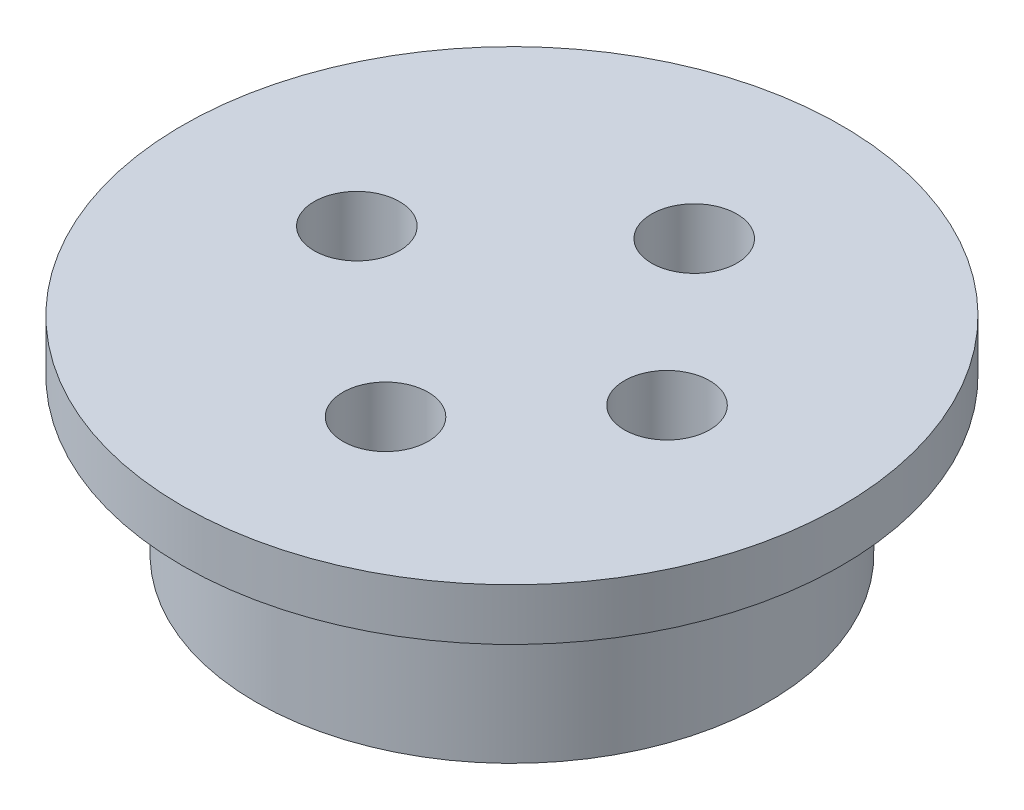
ISO-10303-21;
HEADER;
FILE_DESCRIPTION(('STEP AP214'),'2;1');
FILE_NAME('part.step','',(''),(''),'','','');
FILE_SCHEMA(('AUTOMOTIVE_DESIGN { 1 0 10303 214 1 1 1 1 }'));
ENDSEC;
DATA;
#1=APPLICATION_CONTEXT('core data for automotive mechanical design processes');
#2=APPLICATION_PROTOCOL_DEFINITION('international standard','automotive_design',2000,#1);
#3=PRODUCT_CONTEXT('',#1,'mechanical');
#4=PRODUCT('Part','Part','',(#3));
#5=PRODUCT_RELATED_PRODUCT_CATEGORY('part','',(#4));
#6=PRODUCT_DEFINITION_FORMATION('','',#4);
#7=PRODUCT_DEFINITION_CONTEXT('part definition',#1,'design');
#8=PRODUCT_DEFINITION('design','',#6,#7);
#9=PRODUCT_DEFINITION_SHAPE('','',#8);
#10=(LENGTH_UNIT() NAMED_UNIT(*) SI_UNIT(.MILLI.,.METRE.));
#11=(NAMED_UNIT(*) PLANE_ANGLE_UNIT() SI_UNIT($,.RADIAN.));
#12=(NAMED_UNIT(*) SI_UNIT($,.STERADIAN.) SOLID_ANGLE_UNIT());
#13=UNCERTAINTY_MEASURE_WITH_UNIT(LENGTH_MEASURE(1.E-05),#10,'distance_accuracy_value','');
#14=(GEOMETRIC_REPRESENTATION_CONTEXT(3) GLOBAL_UNCERTAINTY_ASSIGNED_CONTEXT((#13)) GLOBAL_UNIT_ASSIGNED_CONTEXT((#10,
#11,#12)) REPRESENTATION_CONTEXT('',''));
#15=CARTESIAN_POINT('',(0.,0.,0.));
#16=DIRECTION('',(0.,0.,1.));
#17=DIRECTION('',(1.,0.,0.));
#18=AXIS2_PLACEMENT_3D('',#15,#16,#17);
#19=CARTESIAN_POINT('',(-0.930712345753705,-8.,-0.80457804546197));
#20=DIRECTION('',(0.,1.,0.));
#21=DIRECTION('',(0.,0.,1.));
#22=AXIS2_PLACEMENT_3D('',#19,#20,#21);
#23=CYLINDRICAL_SURFACE('',#22,9.9);
#24=CARTESIAN_POINT('',(-0.930712345753705,-8.,-0.80457804546197));
#25=DIRECTION('',(0.,1.,0.));
#26=DIRECTION('',(0.,0.,1.));
#27=AXIS2_PLACEMENT_3D('',#24,#25,#26);
#28=CIRCLE('',#27,9.9);
#29=CARTESIAN_POINT('',(-0.930712345753705,-8.,9.09542195453803));
#30=VERTEX_POINT('',#29);
#31=EDGE_CURVE('E10',#30,#30,#28,.T.);
#32=ORIENTED_EDGE('',*,*,#31,.T.);
#33=EDGE_LOOP('',(#32));
#34=FACE_BOUND('',#33,.T.);
#35=CARTESIAN_POINT('',(-0.930712345753705,-2.,-0.80457804546197));
#36=DIRECTION('',(0.,1.,0.));
#37=DIRECTION('',(0.,0.,1.));
#38=AXIS2_PLACEMENT_3D('',#35,#36,#37);
#39=CIRCLE('',#38,9.9);
#40=CARTESIAN_POINT('',(-0.930712345753705,-2.,9.09542195453803));
#41=VERTEX_POINT('',#40);
#42=EDGE_CURVE('E42',#41,#41,#39,.F.);
#43=ORIENTED_EDGE('',*,*,#42,.T.);
#44=EDGE_LOOP('',(#43));
#45=FACE_BOUND('',#44,.T.);
#46=ADVANCED_FACE('F40',(#34,#45),#23,.T.);
#47=CARTESIAN_POINT('',(-0.930712345753705,-8.,-0.80457804546197));
#48=DIRECTION('',(0.,1.,0.));
#49=DIRECTION('',(0.,0.,1.));
#50=AXIS2_PLACEMENT_3D('',#47,#48,#49);
#51=PLANE('',#50);
#52=CARTESIAN_POINT('',(0.0121816289295595,-8.,5.02797613553002));
#53=DIRECTION('',(0.,1.,0.));
#54=DIRECTION('',(0.,0.,1.));
#55=AXIS2_PLACEMENT_3D('',#52,#53,#54);
#56=CIRCLE('',#55,3.);
#57=CARTESIAN_POINT('',(0.0121816289295595,-8.,8.02797613553002));
#58=VERTEX_POINT('',#57);
#59=EDGE_CURVE('E65',#58,#58,#56,.T.);
#60=ORIENTED_EDGE('',*,*,#59,.T.);
#61=EDGE_LOOP('',(#60));
#62=FACE_BOUND('',#61,.T.);
#63=CARTESIAN_POINT('',(0.0121816289295595,-8.,-6.91406555217959));
#64=DIRECTION('',(0.,1.,0.));
#65=DIRECTION('',(0.,0.,1.));
#66=AXIS2_PLACEMENT_3D('',#63,#64,#65);
#67=CIRCLE('',#66,3.);
#68=CARTESIAN_POINT('',(0.0121816289295595,-8.,-3.91406555217959));
#69=VERTEX_POINT('',#68);
#70=EDGE_CURVE('E70',#69,#69,#67,.T.);
#71=ORIENTED_EDGE('',*,*,#70,.T.);
#72=EDGE_LOOP('',(#71));
#73=FACE_BOUND('',#72,.T.);
#74=CARTESIAN_POINT('',(-6.93071234575371,-8.,-0.80457804546197));
#75=DIRECTION('',(0.,1.,0.));
#76=DIRECTION('',(0.,0.,1.));
#77=AXIS2_PLACEMENT_3D('',#74,#75,#76);
#78=CIRCLE('',#77,1.65);
#79=CARTESIAN_POINT('',(-6.93071234575371,-8.,0.845421954538031));
#80=VERTEX_POINT('',#79);
#81=EDGE_CURVE('E74',#80,#80,#78,.T.);
#82=ORIENTED_EDGE('',*,*,#81,.T.);
#83=EDGE_LOOP('',(#82));
#84=FACE_BOUND('',#83,.T.);
#85=CARTESIAN_POINT('',(5.06928765424629,-8.,-0.80457804546197));
#86=DIRECTION('',(0.,1.,0.));
#87=DIRECTION('',(0.,0.,1.));
#88=AXIS2_PLACEMENT_3D('',#85,#86,#87);
#89=CIRCLE('',#88,1.65);
#90=CARTESIAN_POINT('',(5.06928765424629,-8.,0.84542195453803));
#91=VERTEX_POINT('',#90);
#92=EDGE_CURVE('E58',#91,#91,#89,.T.);
#93=ORIENTED_EDGE('',*,*,#92,.T.);
#94=EDGE_LOOP('',(#93));
#95=FACE_BOUND('',#94,.T.);
#96=ORIENTED_EDGE('',*,*,#31,.F.);
#97=EDGE_LOOP('',(#96));
#98=FACE_BOUND('',#97,.T.);
#99=ADVANCED_FACE('F105',(#62,#73,#84,#95,#98),#51,.F.);
#100=CARTESIAN_POINT('',(-0.930712345753705,-2.,-0.80457804546197));
#101=DIRECTION('',(0.,1.,0.));
#102=DIRECTION('',(0.,0.,1.));
#103=AXIS2_PLACEMENT_3D('',#100,#101,#102);
#104=CYLINDRICAL_SURFACE('',#103,12.75);
#105=CARTESIAN_POINT('',(-0.930712345753705,-2.,-0.80457804546197));
#106=DIRECTION('',(0.,1.,0.));
#107=DIRECTION('',(0.,0.,1.));
#108=AXIS2_PLACEMENT_3D('',#105,#106,#107);
#109=CIRCLE('',#108,12.75);
#110=CARTESIAN_POINT('',(-0.930712345753705,-2.,11.945421954538));
#111=VERTEX_POINT('',#110);
#112=EDGE_CURVE('E47',#111,#111,#109,.T.);
#113=ORIENTED_EDGE('',*,*,#112,.T.);
#114=EDGE_LOOP('',(#113));
#115=FACE_BOUND('',#114,.T.);
#116=CARTESIAN_POINT('',(-0.930712345753705,0.,-0.80457804546197));
#117=DIRECTION('',(0.,1.,0.));
#118=DIRECTION('',(0.,0.,1.));
#119=AXIS2_PLACEMENT_3D('',#116,#117,#118);
#120=CIRCLE('',#119,12.75);
#121=CARTESIAN_POINT('',(-0.930712345753705,0.,11.945421954538));
#122=VERTEX_POINT('',#121);
#123=EDGE_CURVE('E55',#122,#122,#120,.T.);
#124=ORIENTED_EDGE('',*,*,#123,.F.);
#125=EDGE_LOOP('',(#124));
#126=FACE_BOUND('',#125,.T.);
#127=ADVANCED_FACE('F100',(#115,#126),#104,.T.);
#128=CARTESIAN_POINT('',(-0.930712345753705,-2.,-0.80457804546197));
#129=DIRECTION('',(0.,1.,0.));
#130=DIRECTION('',(0.,0.,1.));
#131=AXIS2_PLACEMENT_3D('',#128,#129,#130);
#132=PLANE('',#131);
#133=ORIENTED_EDGE('',*,*,#42,.F.);
#134=EDGE_LOOP('',(#133));
#135=FACE_BOUND('',#134,.T.);
#136=ORIENTED_EDGE('',*,*,#112,.F.);
#137=EDGE_LOOP('',(#136));
#138=FACE_BOUND('',#137,.T.);
#139=ADVANCED_FACE('F103',(#135,#138),#132,.F.);
#140=CARTESIAN_POINT('',(-0.930712345753705,0.,-0.80457804546197));
#141=DIRECTION('',(0.,1.,0.));
#142=DIRECTION('',(0.,0.,1.));
#143=AXIS2_PLACEMENT_3D('',#140,#141,#142);
#144=PLANE('',#143);
#145=CARTESIAN_POINT('',(-6.93071234575371,0.,-0.80457804546197));
#146=DIRECTION('',(0.,1.,0.));
#147=DIRECTION('',(0.,0.,1.));
#148=AXIS2_PLACEMENT_3D('',#145,#146,#147);
#149=CIRCLE('',#148,1.65);
#150=CARTESIAN_POINT('',(-6.93071234575371,0.,0.845421954538031));
#151=VERTEX_POINT('',#150);
#152=EDGE_CURVE('E76',#151,#151,#149,.T.);
#153=ORIENTED_EDGE('',*,*,#152,.F.);
#154=EDGE_LOOP('',(#153));
#155=FACE_BOUND('',#154,.T.);
#156=CARTESIAN_POINT('',(0.0121816289295595,0.,-6.91406555217959));
#157=DIRECTION('',(0.,1.,0.));
#158=DIRECTION('',(0.,0.,1.));
#159=AXIS2_PLACEMENT_3D('',#156,#157,#158);
#160=CIRCLE('',#159,1.65);
#161=CARTESIAN_POINT('',(0.0121816289295595,0.,-5.26406555217959));
#162=VERTEX_POINT('',#161);
#163=EDGE_CURVE('E82',#162,#162,#160,.T.);
#164=ORIENTED_EDGE('',*,*,#163,.F.);
#165=EDGE_LOOP('',(#164));
#166=FACE_BOUND('',#165,.T.);
#167=CARTESIAN_POINT('',(0.0121816289295595,0.,5.02797613553002));
#168=DIRECTION('',(0.,1.,0.));
#169=DIRECTION('',(0.,0.,1.));
#170=AXIS2_PLACEMENT_3D('',#167,#168,#169);
#171=CIRCLE('',#170,1.65);
#172=CARTESIAN_POINT('',(0.0121816289295595,0.,6.67797613553002));
#173=VERTEX_POINT('',#172);
#174=EDGE_CURVE('E81',#173,#173,#171,.T.);
#175=ORIENTED_EDGE('',*,*,#174,.F.);
#176=EDGE_LOOP('',(#175));
#177=FACE_BOUND('',#176,.T.);
#178=CARTESIAN_POINT('',(5.06928765424629,0.,-0.80457804546197));
#179=DIRECTION('',(0.,1.,0.));
#180=DIRECTION('',(0.,0.,1.));
#181=AXIS2_PLACEMENT_3D('',#178,#179,#180);
#182=CIRCLE('',#181,1.65);
#183=CARTESIAN_POINT('',(5.06928765424629,0.,0.84542195453803));
#184=VERTEX_POINT('',#183);
#185=EDGE_CURVE('E90',#184,#184,#182,.T.);
#186=ORIENTED_EDGE('',*,*,#185,.F.);
#187=EDGE_LOOP('',(#186));
#188=FACE_BOUND('',#187,.T.);
#189=ORIENTED_EDGE('',*,*,#123,.T.);
#190=EDGE_LOOP('',(#189));
#191=FACE_BOUND('',#190,.T.);
#192=ADVANCED_FACE('F97',(#155,#166,#177,#188,#191),#144,.T.);
#193=CARTESIAN_POINT('',(5.06928765424629,-8.,-0.80457804546197));
#194=DIRECTION('',(0.,1.,0.));
#195=DIRECTION('',(0.,0.,1.));
#196=AXIS2_PLACEMENT_3D('',#193,#194,#195);
#197=CYLINDRICAL_SURFACE('',#196,1.65);
#198=ORIENTED_EDGE('',*,*,#92,.F.);
#199=EDGE_LOOP('',(#198));
#200=FACE_BOUND('',#199,.T.);
#201=ORIENTED_EDGE('',*,*,#185,.T.);
#202=EDGE_LOOP('',(#201));
#203=FACE_BOUND('',#202,.T.);
#204=ADVANCED_FACE('F140',(#200,#203),#197,.F.);
#205=CARTESIAN_POINT('',(0.0121816289295595,-8.,5.02797613553002));
#206=DIRECTION('',(0.,1.,0.));
#207=DIRECTION('',(0.,0.,1.));
#208=AXIS2_PLACEMENT_3D('',#205,#206,#207);
#209=CYLINDRICAL_SURFACE('',#208,1.65);
#210=CARTESIAN_POINT('',(0.0121816289295595,-4.9,5.02797613553002));
#211=DIRECTION('',(0.,1.,0.));
#212=DIRECTION('',(0.,0.,1.));
#213=AXIS2_PLACEMENT_3D('',#210,#211,#212);
#214=CIRCLE('',#213,1.65);
#215=CARTESIAN_POINT('',(0.0121816289295595,-4.9,6.67797613553002));
#216=VERTEX_POINT('',#215);
#217=EDGE_CURVE('E37',#216,#216,#214,.F.);
#218=ORIENTED_EDGE('',*,*,#217,.T.);
#219=EDGE_LOOP('',(#218));
#220=FACE_BOUND('',#219,.T.);
#221=ORIENTED_EDGE('',*,*,#174,.T.);
#222=EDGE_LOOP('',(#221));
#223=FACE_BOUND('',#222,.T.);
#224=ADVANCED_FACE('F145',(#220,#223),#209,.F.);
#225=CARTESIAN_POINT('',(0.0121816289295595,-8.,-6.91406555217959));
#226=DIRECTION('',(0.,1.,0.));
#227=DIRECTION('',(0.,0.,1.));
#228=AXIS2_PLACEMENT_3D('',#225,#226,#227);
#229=CYLINDRICAL_SURFACE('',#228,1.65);
#230=CARTESIAN_POINT('',(0.0121816289295595,-4.9,-6.91406555217959));
#231=DIRECTION('',(0.,1.,0.));
#232=DIRECTION('',(0.,0.,1.));
#233=AXIS2_PLACEMENT_3D('',#230,#231,#232);
#234=CIRCLE('',#233,1.65);
#235=CARTESIAN_POINT('',(0.0121816289295595,-4.9,-5.26406555217959));
#236=VERTEX_POINT('',#235);
#237=EDGE_CURVE('E53',#236,#236,#234,.F.);
#238=ORIENTED_EDGE('',*,*,#237,.T.);
#239=EDGE_LOOP('',(#238));
#240=FACE_BOUND('',#239,.T.);
#241=ORIENTED_EDGE('',*,*,#163,.T.);
#242=EDGE_LOOP('',(#241));
#243=FACE_BOUND('',#242,.T.);
#244=ADVANCED_FACE('F151',(#240,#243),#229,.F.);
#245=CARTESIAN_POINT('',(-6.93071234575371,-8.,-0.80457804546197));
#246=DIRECTION('',(0.,1.,0.));
#247=DIRECTION('',(0.,0.,1.));
#248=AXIS2_PLACEMENT_3D('',#245,#246,#247);
#249=CYLINDRICAL_SURFACE('',#248,1.65);
#250=ORIENTED_EDGE('',*,*,#81,.F.);
#251=EDGE_LOOP('',(#250));
#252=FACE_BOUND('',#251,.T.);
#253=ORIENTED_EDGE('',*,*,#152,.T.);
#254=EDGE_LOOP('',(#253));
#255=FACE_BOUND('',#254,.T.);
#256=ADVANCED_FACE('F159',(#252,#255),#249,.F.);
#257=CARTESIAN_POINT('',(0.0121816289295595,-4.9,-6.91406555217959));
#258=DIRECTION('',(0.,1.,0.));
#259=DIRECTION('',(0.,0.,1.));
#260=AXIS2_PLACEMENT_3D('',#257,#258,#259);
#261=PLANE('',#260);
#262=CARTESIAN_POINT('',(0.0121816289295595,-4.9,-6.91406555217959));
#263=DIRECTION('',(0.,1.,0.));
#264=DIRECTION('',(0.,0.,1.));
#265=AXIS2_PLACEMENT_3D('',#262,#263,#264);
#266=CIRCLE('',#265,3.);
#267=CARTESIAN_POINT('',(0.0121816289295595,-4.9,-3.91406555217959));
#268=VERTEX_POINT('',#267);
#269=EDGE_CURVE('E75',#268,#268,#266,.T.);
#270=ORIENTED_EDGE('',*,*,#269,.F.);
#271=EDGE_LOOP('',(#270));
#272=FACE_BOUND('',#271,.T.);
#273=ORIENTED_EDGE('',*,*,#237,.F.);
#274=EDGE_LOOP('',(#273));
#275=FACE_BOUND('',#274,.T.);
#276=ADVANCED_FACE('F166',(#272,#275),#261,.F.);
#277=CARTESIAN_POINT('',(0.0121816289295595,-4.9,-6.91406555217959));
#278=DIRECTION('',(0.,-1.,0.));
#279=DIRECTION('',(0.,0.,-1.));
#280=AXIS2_PLACEMENT_3D('',#277,#278,#279);
#281=CYLINDRICAL_SURFACE('',#280,3.);
#282=ORIENTED_EDGE('',*,*,#269,.T.);
#283=EDGE_LOOP('',(#282));
#284=FACE_BOUND('',#283,.T.);
#285=ORIENTED_EDGE('',*,*,#70,.F.);
#286=EDGE_LOOP('',(#285));
#287=FACE_BOUND('',#286,.T.);
#288=ADVANCED_FACE('F180',(#284,#287),#281,.F.);
#289=CARTESIAN_POINT('',(0.0121816289295595,-4.9,5.02797613553002));
#290=DIRECTION('',(0.,1.,0.));
#291=DIRECTION('',(0.,0.,1.));
#292=AXIS2_PLACEMENT_3D('',#289,#290,#291);
#293=PLANE('',#292);
#294=CARTESIAN_POINT('',(0.0121816289295595,-4.9,5.02797613553002));
#295=DIRECTION('',(0.,1.,0.));
#296=DIRECTION('',(0.,0.,1.));
#297=AXIS2_PLACEMENT_3D('',#294,#295,#296);
#298=CIRCLE('',#297,3.);
#299=CARTESIAN_POINT('',(0.0121816289295595,-4.9,8.02797613553002));
#300=VERTEX_POINT('',#299);
#301=EDGE_CURVE('E57',#300,#300,#298,.T.);
#302=ORIENTED_EDGE('',*,*,#301,.F.);
#303=EDGE_LOOP('',(#302));
#304=FACE_BOUND('',#303,.T.);
#305=ORIENTED_EDGE('',*,*,#217,.F.);
#306=EDGE_LOOP('',(#305));
#307=FACE_BOUND('',#306,.T.);
#308=ADVANCED_FACE('F187',(#304,#307),#293,.F.);
#309=CARTESIAN_POINT('',(0.0121816289295595,-4.9,5.02797613553002));
#310=DIRECTION('',(0.,-1.,0.));
#311=DIRECTION('',(0.,0.,-1.));
#312=AXIS2_PLACEMENT_3D('',#309,#310,#311);
#313=CYLINDRICAL_SURFACE('',#312,3.);
#314=ORIENTED_EDGE('',*,*,#301,.T.);
#315=EDGE_LOOP('',(#314));
#316=FACE_BOUND('',#315,.T.);
#317=ORIENTED_EDGE('',*,*,#59,.F.);
#318=EDGE_LOOP('',(#317));
#319=FACE_BOUND('',#318,.T.);
#320=ADVANCED_FACE('F193',(#316,#319),#313,.F.);
#321=CLOSED_SHELL('',(#46,#99,#127,#139,#192,#204,#224,#244,#256,#276,#288,#308,#320));
#322=MANIFOLD_SOLID_BREP('B2',#321);
#323=ADVANCED_BREP_SHAPE_REPRESENTATION('',(#18,#322),#14);
#324=SHAPE_DEFINITION_REPRESENTATION(#9,#323);
ENDSEC;
END-ISO-10303-21;
